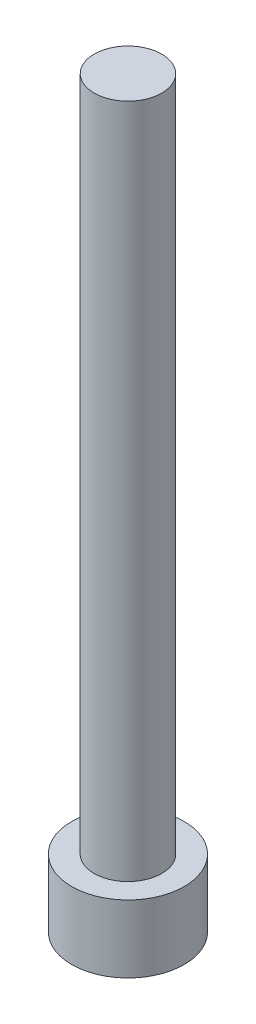
ISO-10303-21;
HEADER;
FILE_DESCRIPTION(('STEP AP214'),'2;1');
FILE_NAME('part.step','',(''),(''),'','','');
FILE_SCHEMA(('AUTOMOTIVE_DESIGN { 1 0 10303 214 1 1 1 1 }'));
ENDSEC;
DATA;
#1=APPLICATION_CONTEXT('core data for automotive mechanical design processes');
#2=APPLICATION_PROTOCOL_DEFINITION('international standard','automotive_design',2000,#1);
#3=PRODUCT_CONTEXT('',#1,'mechanical');
#4=PRODUCT('Part','Part','',(#3));
#5=PRODUCT_RELATED_PRODUCT_CATEGORY('part','',(#4));
#6=PRODUCT_DEFINITION_FORMATION('','',#4);
#7=PRODUCT_DEFINITION_CONTEXT('part definition',#1,'design');
#8=PRODUCT_DEFINITION('design','',#6,#7);
#9=PRODUCT_DEFINITION_SHAPE('','',#8);
#10=(LENGTH_UNIT() NAMED_UNIT(*) SI_UNIT(.MILLI.,.METRE.));
#11=(NAMED_UNIT(*) PLANE_ANGLE_UNIT() SI_UNIT($,.RADIAN.));
#12=(NAMED_UNIT(*) SI_UNIT($,.STERADIAN.) SOLID_ANGLE_UNIT());
#13=UNCERTAINTY_MEASURE_WITH_UNIT(LENGTH_MEASURE(1.E-05),#10,'distance_accuracy_value','');
#14=(GEOMETRIC_REPRESENTATION_CONTEXT(3) GLOBAL_UNCERTAINTY_ASSIGNED_CONTEXT((#13)) GLOBAL_UNIT_ASSIGNED_CONTEXT((#10,
#11,#12)) REPRESENTATION_CONTEXT('',''));
#15=CARTESIAN_POINT('',(0.,0.,0.));
#16=DIRECTION('',(0.,0.,1.));
#17=DIRECTION('',(1.,0.,0.));
#18=AXIS2_PLACEMENT_3D('',#15,#16,#17);
#19=CARTESIAN_POINT('',(0.,3.,0.));
#20=DIRECTION('',(0.,-1.,0.));
#21=DIRECTION('',(0.,0.,-1.));
#22=AXIS2_PLACEMENT_3D('',#19,#20,#21);
#23=CYLINDRICAL_SURFACE('',#22,2.5);
#24=CARTESIAN_POINT('',(0.,3.,0.));
#25=DIRECTION('',(0.,1.,0.));
#26=DIRECTION('',(0.,0.,1.));
#27=AXIS2_PLACEMENT_3D('',#24,#25,#26);
#28=CIRCLE('',#27,2.5);
#29=CARTESIAN_POINT('',(0.,3.,2.5));
#30=VERTEX_POINT('',#29);
#31=EDGE_CURVE('E43',#30,#30,#28,.T.);
#32=ORIENTED_EDGE('',*,*,#31,.F.);
#33=EDGE_LOOP('',(#32));
#34=FACE_BOUND('',#33,.T.);
#35=CARTESIAN_POINT('',(0.,0.,0.));
#36=DIRECTION('',(0.,1.,0.));
#37=DIRECTION('',(0.,0.,1.));
#38=AXIS2_PLACEMENT_3D('',#35,#36,#37);
#39=CIRCLE('',#38,2.5);
#40=CARTESIAN_POINT('',(0.,0.,2.5));
#41=VERTEX_POINT('',#40);
#42=EDGE_CURVE('E38',#41,#41,#39,.T.);
#43=ORIENTED_EDGE('',*,*,#42,.T.);
#44=EDGE_LOOP('',(#43));
#45=FACE_BOUND('',#44,.T.);
#46=ADVANCED_FACE('F35',(#34,#45),#23,.T.);
#47=CARTESIAN_POINT('',(0.,3.,0.));
#48=DIRECTION('',(0.,1.,0.));
#49=DIRECTION('',(0.,0.,1.));
#50=AXIS2_PLACEMENT_3D('',#47,#48,#49);
#51=PLANE('',#50);
#52=CARTESIAN_POINT('',(0.,3.,0.));
#53=DIRECTION('',(0.,1.,0.));
#54=DIRECTION('',(0.,0.,1.));
#55=AXIS2_PLACEMENT_3D('',#52,#53,#54);
#56=CIRCLE('',#55,1.5);
#57=CARTESIAN_POINT('',(0.,3.,1.5));
#58=VERTEX_POINT('',#57);
#59=EDGE_CURVE('E11',#58,#58,#56,.T.);
#60=ORIENTED_EDGE('',*,*,#59,.F.);
#61=EDGE_LOOP('',(#60));
#62=FACE_BOUND('',#61,.T.);
#63=ORIENTED_EDGE('',*,*,#31,.T.);
#64=EDGE_LOOP('',(#63));
#65=FACE_BOUND('',#64,.T.);
#66=ADVANCED_FACE('F155',(#62,#65),#51,.T.);
#67=CARTESIAN_POINT('',(0.,0.,0.));
#68=DIRECTION('',(0.,1.,0.));
#69=DIRECTION('',(0.,0.,1.));
#70=AXIS2_PLACEMENT_3D('',#67,#68,#69);
#71=PLANE('',#70);
#72=DIRECTION('',(-0.5,0.,0.866025403784439));
#73=VECTOR('',#72,1.);
#74=CARTESIAN_POINT('',(1.425,0.,0.));
#75=LINE('',#74,#73);
#76=CARTESIAN_POINT('',(1.425,0.,0.));
#77=VERTEX_POINT('',#76);
#78=CARTESIAN_POINT('',(0.7125,0.,1.23408620039283));
#79=VERTEX_POINT('',#78);
#80=EDGE_CURVE('E125',#77,#79,#75,.T.);
#81=ORIENTED_EDGE('',*,*,#80,.F.);
#82=DIRECTION('',(0.5,0.,0.866025403784439));
#83=VECTOR('',#82,1.);
#84=CARTESIAN_POINT('',(0.7125,0.,-1.23408620039283));
#85=LINE('',#84,#83);
#86=CARTESIAN_POINT('',(0.7125,0.,-1.23408620039283));
#87=VERTEX_POINT('',#86);
#88=EDGE_CURVE('E51',#87,#77,#85,.T.);
#89=ORIENTED_EDGE('',*,*,#88,.F.);
#90=DIRECTION('',(1.,0.,0.));
#91=VECTOR('',#90,1.);
#92=CARTESIAN_POINT('',(-0.7125,0.,-1.23408620039283));
#93=LINE('',#92,#91);
#94=CARTESIAN_POINT('',(-0.7125,0.,-1.23408620039283));
#95=VERTEX_POINT('',#94);
#96=EDGE_CURVE('E134',#95,#87,#93,.T.);
#97=ORIENTED_EDGE('',*,*,#96,.F.);
#98=DIRECTION('',(0.5,0.,-0.866025403784439));
#99=VECTOR('',#98,1.);
#100=CARTESIAN_POINT('',(-1.425,0.,0.));
#101=LINE('',#100,#99);
#102=CARTESIAN_POINT('',(-1.425,0.,0.));
#103=VERTEX_POINT('',#102);
#104=EDGE_CURVE('E132',#103,#95,#101,.T.);
#105=ORIENTED_EDGE('',*,*,#104,.F.);
#106=DIRECTION('',(-0.5,0.,-0.866025403784439));
#107=VECTOR('',#106,1.);
#108=CARTESIAN_POINT('',(-0.7125,0.,1.23408620039283));
#109=LINE('',#108,#107);
#110=CARTESIAN_POINT('',(-0.7125,0.,1.23408620039283));
#111=VERTEX_POINT('',#110);
#112=EDGE_CURVE('E99',#111,#103,#109,.T.);
#113=ORIENTED_EDGE('',*,*,#112,.F.);
#114=DIRECTION('',(-1.,0.,0.));
#115=VECTOR('',#114,1.);
#116=CARTESIAN_POINT('',(0.7125,0.,1.23408620039283));
#117=LINE('',#116,#115);
#118=EDGE_CURVE('E128',#79,#111,#117,.T.);
#119=ORIENTED_EDGE('',*,*,#118,.F.);
#120=EDGE_LOOP('',(#81,#89,#97,#105,#113,#119));
#121=FACE_BOUND('',#120,.T.);
#122=ORIENTED_EDGE('',*,*,#42,.F.);
#123=EDGE_LOOP('',(#122));
#124=FACE_BOUND('',#123,.T.);
#125=ADVANCED_FACE('F152',(#121,#124),#71,.F.);
#126=CARTESIAN_POINT('',(0.,33.,0.));
#127=DIRECTION('',(0.,-1.,0.));
#128=DIRECTION('',(0.,0.,-1.));
#129=AXIS2_PLACEMENT_3D('',#126,#127,#128);
#130=CYLINDRICAL_SURFACE('',#129,1.5);
#131=CARTESIAN_POINT('',(0.,33.,0.));
#132=DIRECTION('',(0.,1.,0.));
#133=DIRECTION('',(0.,0.,1.));
#134=AXIS2_PLACEMENT_3D('',#131,#132,#133);
#135=CIRCLE('',#134,1.5);
#136=CARTESIAN_POINT('',(0.,33.,1.5));
#137=VERTEX_POINT('',#136);
#138=EDGE_CURVE('E138',#137,#137,#135,.T.);
#139=ORIENTED_EDGE('',*,*,#138,.F.);
#140=EDGE_LOOP('',(#139));
#141=FACE_BOUND('',#140,.T.);
#142=ORIENTED_EDGE('',*,*,#59,.T.);
#143=EDGE_LOOP('',(#142));
#144=FACE_BOUND('',#143,.T.);
#145=ADVANCED_FACE('F154',(#141,#144),#130,.T.);
#146=CARTESIAN_POINT('',(0.,33.,0.));
#147=DIRECTION('',(0.,1.,0.));
#148=DIRECTION('',(0.,0.,1.));
#149=AXIS2_PLACEMENT_3D('',#146,#147,#148);
#150=PLANE('',#149);
#151=ORIENTED_EDGE('',*,*,#138,.T.);
#152=EDGE_LOOP('',(#151));
#153=FACE_BOUND('',#152,.T.);
#154=ADVANCED_FACE('F161',(#153),#150,.T.);
#155=CARTESIAN_POINT('',(0.7125,1.65,-1.23408620039283));
#156=DIRECTION('',(0.866025403784439,0.,-0.5));
#157=DIRECTION('',(-0.5,0.,-0.866025403784439));
#158=AXIS2_PLACEMENT_3D('',#155,#156,#157);
#159=PLANE('',#158);
#160=ORIENTED_EDGE('',*,*,#88,.T.);
#161=DIRECTION('',(0.,-1.,0.));
#162=VECTOR('',#161,1.);
#163=CARTESIAN_POINT('',(1.425,1.65,0.));
#164=LINE('',#163,#162);
#165=CARTESIAN_POINT('',(1.425,1.65,0.));
#166=VERTEX_POINT('',#165);
#167=EDGE_CURVE('E81',#166,#77,#164,.T.);
#168=ORIENTED_EDGE('',*,*,#167,.F.);
#169=DIRECTION('',(0.5,0.,0.866025403784439));
#170=VECTOR('',#169,1.);
#171=CARTESIAN_POINT('',(0.7125,1.65,-1.23408620039283));
#172=LINE('',#171,#170);
#173=CARTESIAN_POINT('',(0.7125,1.65,-1.23408620039283));
#174=VERTEX_POINT('',#173);
#175=EDGE_CURVE('E136',#174,#166,#172,.T.);
#176=ORIENTED_EDGE('',*,*,#175,.F.);
#177=DIRECTION('',(0.,-1.,0.));
#178=VECTOR('',#177,1.);
#179=CARTESIAN_POINT('',(0.7125,1.65,-1.23408620039283));
#180=LINE('',#179,#178);
#181=EDGE_CURVE('E59',#174,#87,#180,.T.);
#182=ORIENTED_EDGE('',*,*,#181,.T.);
#183=EDGE_LOOP('',(#160,#168,#176,#182));
#184=FACE_BOUND('',#183,.T.);
#185=ADVANCED_FACE('F190',(#184),#159,.F.);
#186=CARTESIAN_POINT('',(-0.7125,1.65,-1.23408620039283));
#187=DIRECTION('',(0.,0.,-1.));
#188=DIRECTION('',(-1.,0.,0.));
#189=AXIS2_PLACEMENT_3D('',#186,#187,#188);
#190=PLANE('',#189);
#191=ORIENTED_EDGE('',*,*,#96,.T.);
#192=ORIENTED_EDGE('',*,*,#181,.F.);
#193=DIRECTION('',(1.,0.,0.));
#194=VECTOR('',#193,1.);
#195=CARTESIAN_POINT('',(-0.7125,1.65,-1.23408620039283));
#196=LINE('',#195,#194);
#197=CARTESIAN_POINT('',(-0.7125,1.65,-1.23408620039283));
#198=VERTEX_POINT('',#197);
#199=EDGE_CURVE('E111',#198,#174,#196,.T.);
#200=ORIENTED_EDGE('',*,*,#199,.F.);
#201=DIRECTION('',(0.,-1.,0.));
#202=VECTOR('',#201,1.);
#203=CARTESIAN_POINT('',(-0.7125,1.65,-1.23408620039283));
#204=LINE('',#203,#202);
#205=EDGE_CURVE('E103',#198,#95,#204,.T.);
#206=ORIENTED_EDGE('',*,*,#205,.T.);
#207=EDGE_LOOP('',(#191,#192,#200,#206));
#208=FACE_BOUND('',#207,.T.);
#209=ADVANCED_FACE('F204',(#208),#190,.F.);
#210=CARTESIAN_POINT('',(-1.425,1.65,0.));
#211=DIRECTION('',(-0.866025403784439,0.,-0.5));
#212=DIRECTION('',(-0.5,0.,0.866025403784439));
#213=AXIS2_PLACEMENT_3D('',#210,#211,#212);
#214=PLANE('',#213);
#215=ORIENTED_EDGE('',*,*,#104,.T.);
#216=ORIENTED_EDGE('',*,*,#205,.F.);
#217=DIRECTION('',(0.5,0.,-0.866025403784439));
#218=VECTOR('',#217,1.);
#219=CARTESIAN_POINT('',(-1.425,1.65,0.));
#220=LINE('',#219,#218);
#221=CARTESIAN_POINT('',(-1.425,1.65,0.));
#222=VERTEX_POINT('',#221);
#223=EDGE_CURVE('E107',#222,#198,#220,.T.);
#224=ORIENTED_EDGE('',*,*,#223,.F.);
#225=DIRECTION('',(0.,-1.,0.));
#226=VECTOR('',#225,1.);
#227=CARTESIAN_POINT('',(-1.425,1.65,0.));
#228=LINE('',#227,#226);
#229=EDGE_CURVE('E92',#222,#103,#228,.T.);
#230=ORIENTED_EDGE('',*,*,#229,.T.);
#231=EDGE_LOOP('',(#215,#216,#224,#230));
#232=FACE_BOUND('',#231,.T.);
#233=ADVANCED_FACE('F108',(#232),#214,.F.);
#234=CARTESIAN_POINT('',(-0.7125,1.65,1.23408620039283));
#235=DIRECTION('',(-0.866025403784439,0.,0.5));
#236=DIRECTION('',(0.5,0.,0.866025403784439));
#237=AXIS2_PLACEMENT_3D('',#234,#235,#236);
#238=PLANE('',#237);
#239=ORIENTED_EDGE('',*,*,#112,.T.);
#240=ORIENTED_EDGE('',*,*,#229,.F.);
#241=DIRECTION('',(-0.5,0.,-0.866025403784439));
#242=VECTOR('',#241,1.);
#243=CARTESIAN_POINT('',(-0.7125,1.65,1.23408620039283));
#244=LINE('',#243,#242);
#245=CARTESIAN_POINT('',(-0.7125,1.65,1.23408620039283));
#246=VERTEX_POINT('',#245);
#247=EDGE_CURVE('E96',#246,#222,#244,.T.);
#248=ORIENTED_EDGE('',*,*,#247,.F.);
#249=DIRECTION('',(0.,-1.,0.));
#250=VECTOR('',#249,1.);
#251=CARTESIAN_POINT('',(-0.7125,1.65,1.23408620039283));
#252=LINE('',#251,#250);
#253=EDGE_CURVE('E104',#246,#111,#252,.T.);
#254=ORIENTED_EDGE('',*,*,#253,.T.);
#255=EDGE_LOOP('',(#239,#240,#248,#254));
#256=FACE_BOUND('',#255,.T.);
#257=ADVANCED_FACE('F94',(#256),#238,.F.);
#258=CARTESIAN_POINT('',(0.7125,1.65,1.23408620039283));
#259=DIRECTION('',(0.,0.,1.));
#260=DIRECTION('',(1.,0.,0.));
#261=AXIS2_PLACEMENT_3D('',#258,#259,#260);
#262=PLANE('',#261);
#263=ORIENTED_EDGE('',*,*,#118,.T.);
#264=ORIENTED_EDGE('',*,*,#253,.F.);
#265=DIRECTION('',(-1.,0.,0.));
#266=VECTOR('',#265,1.);
#267=CARTESIAN_POINT('',(0.7125,1.65,1.23408620039283));
#268=LINE('',#267,#266);
#269=CARTESIAN_POINT('',(0.7125,1.65,1.23408620039283));
#270=VERTEX_POINT('',#269);
#271=EDGE_CURVE('E117',#270,#246,#268,.T.);
#272=ORIENTED_EDGE('',*,*,#271,.F.);
#273=DIRECTION('',(0.,-1.,0.));
#274=VECTOR('',#273,1.);
#275=CARTESIAN_POINT('',(0.7125,1.65,1.23408620039283));
#276=LINE('',#275,#274);
#277=EDGE_CURVE('E141',#270,#79,#276,.T.);
#278=ORIENTED_EDGE('',*,*,#277,.T.);
#279=EDGE_LOOP('',(#263,#264,#272,#278));
#280=FACE_BOUND('',#279,.T.);
#281=ADVANCED_FACE('F229',(#280),#262,.F.);
#282=CARTESIAN_POINT('',(1.425,1.65,0.));
#283=DIRECTION('',(0.866025403784439,0.,0.5));
#284=DIRECTION('',(0.5,0.,-0.866025403784438));
#285=AXIS2_PLACEMENT_3D('',#282,#283,#284);
#286=PLANE('',#285);
#287=ORIENTED_EDGE('',*,*,#80,.T.);
#288=ORIENTED_EDGE('',*,*,#277,.F.);
#289=DIRECTION('',(-0.5,0.,0.866025403784439));
#290=VECTOR('',#289,1.);
#291=CARTESIAN_POINT('',(1.425,1.65,0.));
#292=LINE('',#291,#290);
#293=EDGE_CURVE('E119',#166,#270,#292,.T.);
#294=ORIENTED_EDGE('',*,*,#293,.F.);
#295=ORIENTED_EDGE('',*,*,#167,.T.);
#296=EDGE_LOOP('',(#287,#288,#294,#295));
#297=FACE_BOUND('',#296,.T.);
#298=ADVANCED_FACE('F238',(#297),#286,.F.);
#299=CARTESIAN_POINT('',(0.,1.65,0.));
#300=DIRECTION('',(0.,-1.,0.));
#301=DIRECTION('',(0.,0.,-1.));
#302=AXIS2_PLACEMENT_3D('',#299,#300,#301);
#303=PLANE('',#302);
#304=ORIENTED_EDGE('',*,*,#175,.T.);
#305=ORIENTED_EDGE('',*,*,#293,.T.);
#306=ORIENTED_EDGE('',*,*,#271,.T.);
#307=ORIENTED_EDGE('',*,*,#247,.T.);
#308=ORIENTED_EDGE('',*,*,#223,.T.);
#309=ORIENTED_EDGE('',*,*,#199,.T.);
#310=EDGE_LOOP('',(#304,#305,#306,#307,#308,#309));
#311=FACE_BOUND('',#310,.T.);
#312=ADVANCED_FACE('F114',(#311),#303,.T.);
#313=CLOSED_SHELL('',(#46,#66,#125,#145,#154,#185,#209,#233,#257,#281,#298,#312));
#314=MANIFOLD_SOLID_BREP('B2',#313);
#315=ADVANCED_BREP_SHAPE_REPRESENTATION('',(#18,#314),#14);
#316=SHAPE_DEFINITION_REPRESENTATION(#9,#315);
ENDSEC;
END-ISO-10303-21;
